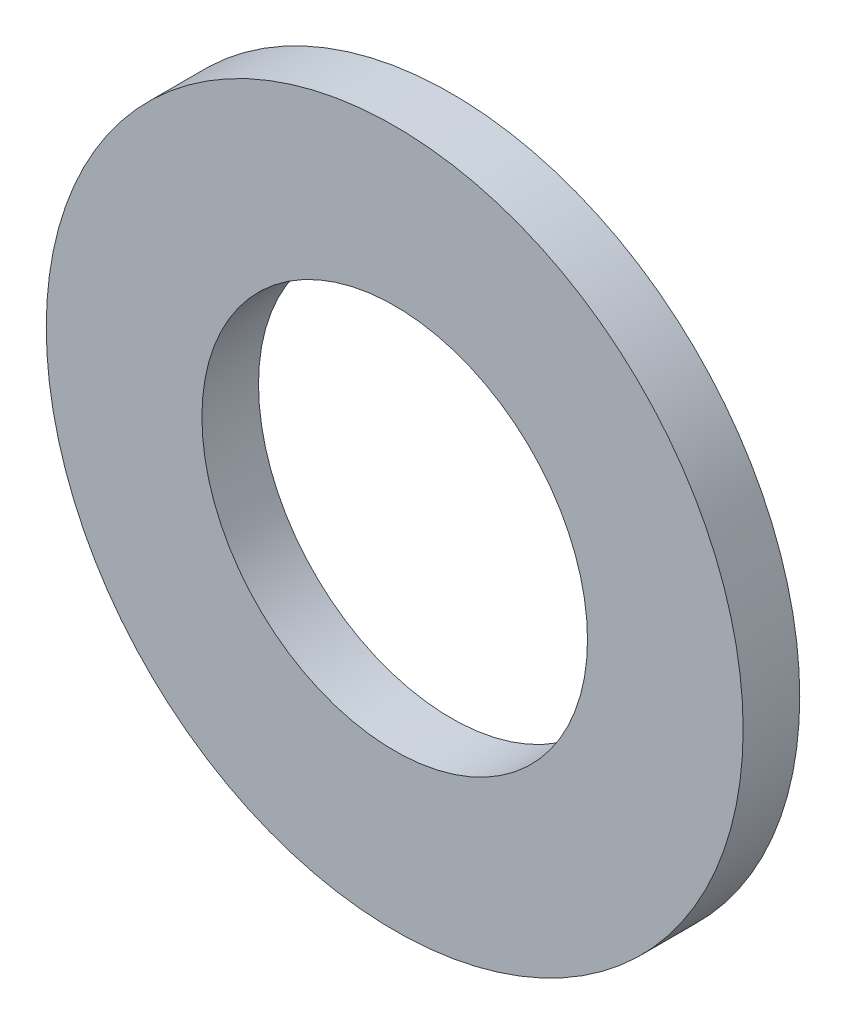
ISO-10303-21;
HEADER;
FILE_DESCRIPTION(('STEP AP214'),'2;1');
FILE_NAME('part.step','',(''),(''),'','','');
FILE_SCHEMA(('AUTOMOTIVE_DESIGN { 1 0 10303 214 1 1 1 1 }'));
ENDSEC;
DATA;
#1=APPLICATION_CONTEXT('core data for automotive mechanical design processes');
#2=APPLICATION_PROTOCOL_DEFINITION('international standard','automotive_design',2000,#1);
#3=PRODUCT_CONTEXT('',#1,'mechanical');
#4=PRODUCT('Part','Part','',(#3));
#5=PRODUCT_RELATED_PRODUCT_CATEGORY('part','',(#4));
#6=PRODUCT_DEFINITION_FORMATION('','',#4);
#7=PRODUCT_DEFINITION_CONTEXT('part definition',#1,'design');
#8=PRODUCT_DEFINITION('design','',#6,#7);
#9=PRODUCT_DEFINITION_SHAPE('','',#8);
#10=(LENGTH_UNIT() NAMED_UNIT(*) SI_UNIT(.MILLI.,.METRE.));
#11=(NAMED_UNIT(*) PLANE_ANGLE_UNIT() SI_UNIT($,.RADIAN.));
#12=(NAMED_UNIT(*) SI_UNIT($,.STERADIAN.) SOLID_ANGLE_UNIT());
#13=UNCERTAINTY_MEASURE_WITH_UNIT(LENGTH_MEASURE(1.E-05),#10,'distance_accuracy_value','');
#14=(GEOMETRIC_REPRESENTATION_CONTEXT(3) GLOBAL_UNCERTAINTY_ASSIGNED_CONTEXT((#13)) GLOBAL_UNIT_ASSIGNED_CONTEXT((#10,
#11,#12)) REPRESENTATION_CONTEXT('',''));
#15=CARTESIAN_POINT('',(0.,0.,0.));
#16=DIRECTION('',(0.,0.,1.));
#17=DIRECTION('',(1.,0.,0.));
#18=AXIS2_PLACEMENT_3D('',#15,#16,#17);
#19=CARTESIAN_POINT('',(0.,0.,0.8));
#20=DIRECTION('',(0.,0.,1.));
#21=DIRECTION('',(1.,0.,0.));
#22=AXIS2_PLACEMENT_3D('',#19,#20,#21);
#23=PLANE('',#22);
#24=CARTESIAN_POINT('',(0.,0.,0.8));
#25=DIRECTION('',(0.,0.,1.));
#26=DIRECTION('',(1.,0.,0.));
#27=AXIS2_PLACEMENT_3D('',#24,#25,#26);
#28=CIRCLE('',#27,9.85);
#29=CARTESIAN_POINT('',(9.85,0.,0.8));
#30=VERTEX_POINT('',#29);
#31=EDGE_CURVE('E10',#30,#30,#28,.T.);
#32=ORIENTED_EDGE('',*,*,#31,.T.);
#33=EDGE_LOOP('',(#32));
#34=FACE_BOUND('',#33,.T.);
#35=CARTESIAN_POINT('',(0.,0.,0.8));
#36=DIRECTION('',(0.,0.,1.));
#37=DIRECTION('',(1.,0.,0.));
#38=AXIS2_PLACEMENT_3D('',#35,#36,#37);
#39=CIRCLE('',#38,5.45);
#40=CARTESIAN_POINT('',(5.45,0.,0.8));
#41=VERTEX_POINT('',#40);
#42=EDGE_CURVE('E46',#41,#41,#39,.T.);
#43=ORIENTED_EDGE('',*,*,#42,.F.);
#44=EDGE_LOOP('',(#43));
#45=FACE_BOUND('',#44,.T.);
#46=ADVANCED_FACE('F35',(#34,#45),#23,.T.);
#47=CARTESIAN_POINT('',(0.,0.,-0.8));
#48=DIRECTION('',(0.,0.,1.));
#49=DIRECTION('',(1.,0.,0.));
#50=AXIS2_PLACEMENT_3D('',#47,#48,#49);
#51=PLANE('',#50);
#52=CARTESIAN_POINT('',(0.,0.,-0.8));
#53=DIRECTION('',(0.,0.,1.));
#54=DIRECTION('',(1.,0.,0.));
#55=AXIS2_PLACEMENT_3D('',#52,#53,#54);
#56=CIRCLE('',#55,9.85);
#57=CARTESIAN_POINT('',(9.85,0.,-0.8));
#58=VERTEX_POINT('',#57);
#59=EDGE_CURVE('E39',#58,#58,#56,.T.);
#60=ORIENTED_EDGE('',*,*,#59,.F.);
#61=EDGE_LOOP('',(#60));
#62=FACE_BOUND('',#61,.T.);
#63=CARTESIAN_POINT('',(0.,0.,-0.8));
#64=DIRECTION('',(0.,0.,1.));
#65=DIRECTION('',(1.,0.,0.));
#66=AXIS2_PLACEMENT_3D('',#63,#64,#65);
#67=CIRCLE('',#66,5.45);
#68=CARTESIAN_POINT('',(5.45,0.,-0.8));
#69=VERTEX_POINT('',#68);
#70=EDGE_CURVE('E48',#69,#69,#67,.T.);
#71=ORIENTED_EDGE('',*,*,#70,.T.);
#72=EDGE_LOOP('',(#71));
#73=FACE_BOUND('',#72,.T.);
#74=ADVANCED_FACE('F58',(#62,#73),#51,.F.);
#75=CARTESIAN_POINT('',(0.,0.,0.8));
#76=DIRECTION('',(0.,0.,-1.));
#77=DIRECTION('',(-1.,0.,0.));
#78=AXIS2_PLACEMENT_3D('',#75,#76,#77);
#79=CYLINDRICAL_SURFACE('',#78,9.85);
#80=ORIENTED_EDGE('',*,*,#31,.F.);
#81=EDGE_LOOP('',(#80));
#82=FACE_BOUND('',#81,.T.);
#83=ORIENTED_EDGE('',*,*,#59,.T.);
#84=EDGE_LOOP('',(#83));
#85=FACE_BOUND('',#84,.T.);
#86=ADVANCED_FACE('F37',(#82,#85),#79,.T.);
#87=CARTESIAN_POINT('',(0.,0.,0.8));
#88=DIRECTION('',(0.,0.,-1.));
#89=DIRECTION('',(-1.,0.,0.));
#90=AXIS2_PLACEMENT_3D('',#87,#88,#89);
#91=CYLINDRICAL_SURFACE('',#90,5.45);
#92=ORIENTED_EDGE('',*,*,#42,.T.);
#93=EDGE_LOOP('',(#92));
#94=FACE_BOUND('',#93,.T.);
#95=ORIENTED_EDGE('',*,*,#70,.F.);
#96=EDGE_LOOP('',(#95));
#97=FACE_BOUND('',#96,.T.);
#98=ADVANCED_FACE('F54',(#94,#97),#91,.F.);
#99=CLOSED_SHELL('',(#46,#74,#86,#98));
#100=MANIFOLD_SOLID_BREP('B2',#99);
#101=ADVANCED_BREP_SHAPE_REPRESENTATION('',(#18,#100),#14);
#102=SHAPE_DEFINITION_REPRESENTATION(#9,#101);
ENDSEC;
END-ISO-10303-21;
